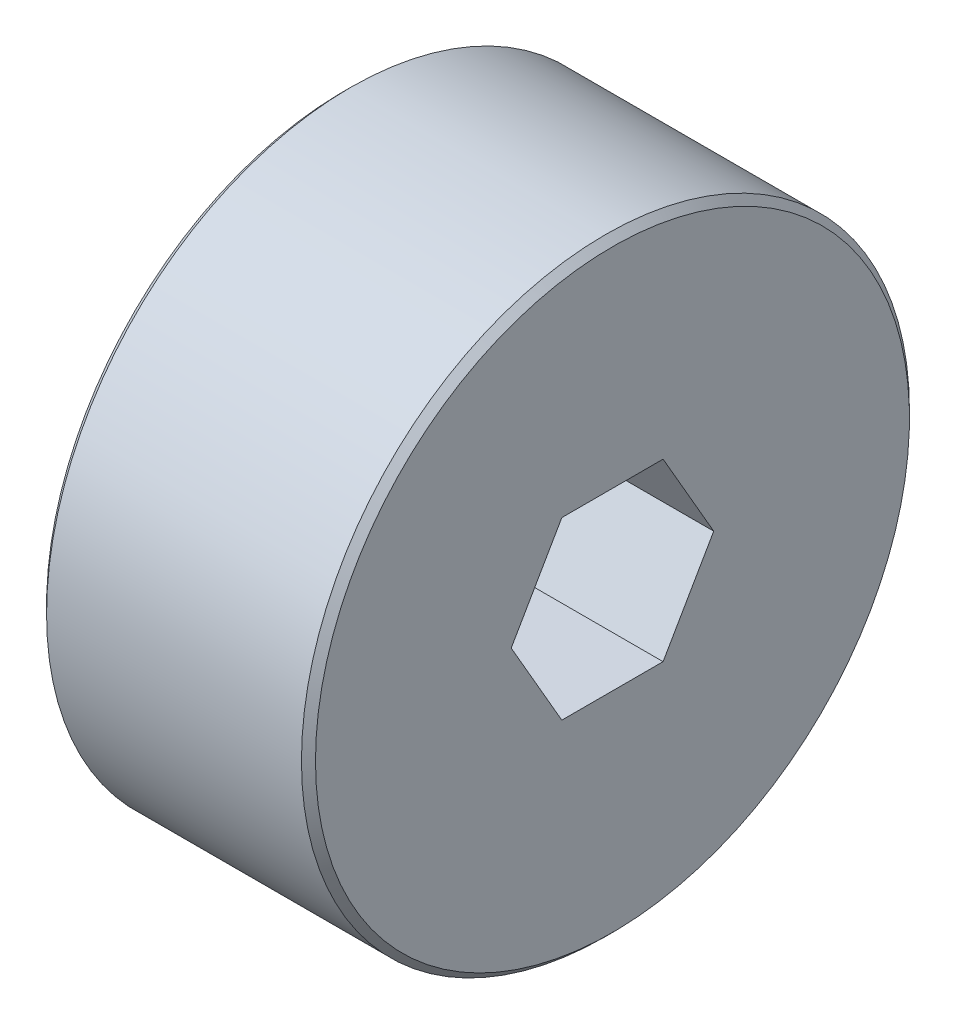
ISO-10303-21;
HEADER;
FILE_DESCRIPTION(('STEP AP214'),'2;1');
FILE_NAME('part.step','',(''),(''),'','','');
FILE_SCHEMA(('AUTOMOTIVE_DESIGN { 1 0 10303 214 1 1 1 1 }'));
ENDSEC;
DATA;
#1=APPLICATION_CONTEXT('core data for automotive mechanical design processes');
#2=APPLICATION_PROTOCOL_DEFINITION('international standard','automotive_design',2000,#1);
#3=PRODUCT_CONTEXT('',#1,'mechanical');
#4=PRODUCT('Part','Part','',(#3));
#5=PRODUCT_RELATED_PRODUCT_CATEGORY('part','',(#4));
#6=PRODUCT_DEFINITION_FORMATION('','',#4);
#7=PRODUCT_DEFINITION_CONTEXT('part definition',#1,'design');
#8=PRODUCT_DEFINITION('design','',#6,#7);
#9=PRODUCT_DEFINITION_SHAPE('','',#8);
#10=(LENGTH_UNIT() NAMED_UNIT(*) SI_UNIT(.MILLI.,.METRE.));
#11=(NAMED_UNIT(*) PLANE_ANGLE_UNIT() SI_UNIT($,.RADIAN.));
#12=(NAMED_UNIT(*) SI_UNIT($,.STERADIAN.) SOLID_ANGLE_UNIT());
#13=UNCERTAINTY_MEASURE_WITH_UNIT(LENGTH_MEASURE(1.E-05),#10,'distance_accuracy_value','');
#14=(GEOMETRIC_REPRESENTATION_CONTEXT(3) GLOBAL_UNCERTAINTY_ASSIGNED_CONTEXT((#13)) GLOBAL_UNIT_ASSIGNED_CONTEXT((#10,
#11,#12)) REPRESENTATION_CONTEXT('',''));
#15=CARTESIAN_POINT('',(0.,0.,0.));
#16=DIRECTION('',(0.,0.,1.));
#17=DIRECTION('',(1.,0.,0.));
#18=AXIS2_PLACEMENT_3D('',#15,#16,#17);
#19=CARTESIAN_POINT('',(814.277078421179,288.105971524835,0.));
#20=DIRECTION('',(1.,0.,0.));
#21=DIRECTION('',(0.,0.,-1.));
#22=AXIS2_PLACEMENT_3D('',#19,#20,#21);
#23=CONICAL_SURFACE('',#22,7.93749999988602,0.785398162499982);
#24=CARTESIAN_POINT('',(814.277078421065,288.105971524835,0.));
#25=DIRECTION('',(1.,0.,0.));
#26=DIRECTION('',(0.,0.,-1.));
#27=AXIS2_PLACEMENT_3D('',#24,#25,#26);
#28=CIRCLE('',#27,7.9375);
#29=CARTESIAN_POINT('',(814.277078421065,288.105971524835,-7.9375));
#30=VERTEX_POINT('',#29);
#31=EDGE_CURVE('E150',#30,#30,#28,.T.);
#32=ORIENTED_EDGE('',*,*,#31,.F.);
#33=EDGE_LOOP('',(#32));
#34=FACE_BOUND('',#33,.T.);
#35=CARTESIAN_POINT('',(814.023078420951,288.105971524835,0.));
#36=DIRECTION('',(1.,0.,0.));
#37=DIRECTION('',(0.,0.,-1.));
#38=AXIS2_PLACEMENT_3D('',#35,#36,#37);
#39=CIRCLE('',#38,7.68350000011392);
#40=CARTESIAN_POINT('',(814.023078420951,288.105971524835,-7.68350000011392));
#41=VERTEX_POINT('',#40);
#42=EDGE_CURVE('E21',#41,#41,#39,.F.);
#43=ORIENTED_EDGE('',*,*,#42,.F.);
#44=EDGE_LOOP('',(#43));
#45=FACE_BOUND('',#44,.T.);
#46=ADVANCED_FACE('F17',(#34,#45),#23,.T.);
#47=CARTESIAN_POINT('',(814.023078421065,292.074721524835,0.));
#48=DIRECTION('',(-1.,0.,0.));
#49=DIRECTION('',(0.,0.,1.));
#50=AXIS2_PLACEMENT_3D('',#47,#48,#49);
#51=PLANE('',#50);
#52=CARTESIAN_POINT('',(814.023078420746,288.105971524835,0.));
#53=DIRECTION('',(-1.,0.,0.));
#54=DIRECTION('',(0.,0.,1.));
#55=AXIS2_PLACEMENT_3D('',#52,#53,#54);
#56=CIRCLE('',#55,5.52449999974425);
#57=CARTESIAN_POINT('',(814.023078420746,288.105971524835,5.52449999974425));
#58=VERTEX_POINT('',#57);
#59=EDGE_CURVE('E118',#58,#58,#56,.F.);
#60=ORIENTED_EDGE('',*,*,#59,.T.);
#61=EDGE_LOOP('',(#60));
#62=FACE_BOUND('',#61,.T.);
#63=ORIENTED_EDGE('',*,*,#42,.T.);
#64=EDGE_LOOP('',(#63));
#65=FACE_BOUND('',#64,.T.);
#66=ADVANCED_FACE('F338',(#62,#65),#51,.T.);
#67=CARTESIAN_POINT('',(814.340578421065,288.105971524835,0.));
#68=DIRECTION('',(1.,0.,0.));
#69=DIRECTION('',(0.,0.,-1.));
#70=AXIS2_PLACEMENT_3D('',#67,#68,#69);
#71=CYLINDRICAL_SURFACE('',#70,7.9375);
#72=CARTESIAN_POINT('',(814.404078421065,288.105971524835,0.));
#73=DIRECTION('',(1.,0.,0.));
#74=DIRECTION('',(0.,0.,-1.));
#75=AXIS2_PLACEMENT_3D('',#72,#73,#74);
#76=CIRCLE('',#75,7.93749999999999);
#77=CARTESIAN_POINT('',(814.404078421065,288.105971524835,-7.93749999999999));
#78=VERTEX_POINT('',#77);
#79=EDGE_CURVE('E85',#78,#78,#76,.T.);
#80=ORIENTED_EDGE('',*,*,#79,.F.);
#81=EDGE_LOOP('',(#80));
#82=FACE_BOUND('',#81,.T.);
#83=ORIENTED_EDGE('',*,*,#31,.T.);
#84=EDGE_LOOP('',(#83));
#85=FACE_BOUND('',#84,.T.);
#86=ADVANCED_FACE('F330',(#82,#85),#71,.T.);
#87=CARTESIAN_POINT('',(814.023078420803,288.105971524835,0.));
#88=DIRECTION('',(-1.,0.,0.));
#89=DIRECTION('',(0.,0.,1.));
#90=AXIS2_PLACEMENT_3D('',#87,#88,#89);
#91=CONICAL_SURFACE('',#90,5.5244999996874,0.785398162507615);
#92=ORIENTED_EDGE('',*,*,#59,.F.);
#93=EDGE_LOOP('',(#92));
#94=FACE_BOUND('',#93,.T.);
#95=CARTESIAN_POINT('',(814.048317106639,288.105971524631,5.49926131399009));
#96=CARTESIAN_POINT('',(814.095276713428,288.024623411087,5.45229495868878));
#97=CARTESIAN_POINT('',(814.14080432843,287.942653725722,5.40496973875758));
#98=CARTESIAN_POINT('',(814.228563619718,287.777350388181,5.30953181231453));
#99=CARTESIAN_POINT('',(814.270793501319,287.694016022754,5.26141869400755));
#100=CARTESIAN_POINT('',(814.392296850374,287.440910903982,5.11528838555948));
#101=CARTESIAN_POINT('',(814.465810044093,287.269011053323,5.01604196050402));
#102=CARTESIAN_POINT('',(814.592709375881,286.920203964327,4.81465809377386));
#103=CARTESIAN_POINT('',(814.646163632112,286.743315907082,4.71253172630691));
#104=CARTESIAN_POINT('',(814.707958642217,286.475098749803,4.5576764783527));
#105=CARTESIAN_POINT('',(814.725482238726,286.385324836492,4.50584548533751));
#106=CARTESIAN_POINT('',(814.75400261081,286.205013555752,4.40174271886136));
#107=CARTESIAN_POINT('',(814.765001556536,286.11447645234,4.34947109783016));
#108=CARTESIAN_POINT('',(814.7767347939,285.973970743115,4.2683500887954));
#109=CARTESIAN_POINT('',(814.779861438079,285.924144265866,4.23958275874976));
#110=CARTESIAN_POINT('',(814.784033652413,285.82445460277,4.1820269049065));
#111=CARTESIAN_POINT('',(814.78508035307,285.774591451607,4.15323840113445));
#112=CARTESIAN_POINT('',(814.785073574796,285.599557812022,4.05218268216171));
#113=CARTESIAN_POINT('',(814.778463276719,285.474351418993,3.97989473749762));
#114=CARTESIAN_POINT('',(814.752384357275,285.224898800092,3.83587320086616));
#115=CARTESIAN_POINT('',(814.732906767529,285.100653305109,3.764140030877));
#116=CARTESIAN_POINT('',(814.682008968795,284.853436092213,3.62140910645207));
#117=CARTESIAN_POINT('',(814.650533839888,284.730472944217,3.55041629986063));
#118=CARTESIAN_POINT('',(814.577079766671,284.486910875475,3.40979567391092));
#119=CARTESIAN_POINT('',(814.535096769832,284.366312886285,3.34016839238749));
#120=CARTESIAN_POINT('',(814.427994134356,284.091302146559,3.18139086777519));
#121=CARTESIAN_POINT('',(814.359724319717,283.937811006125,3.09277271652804));
#122=CARTESIAN_POINT('',(814.248663318791,283.711659062559,2.96220383103236));
#123=CARTESIAN_POINT('',(814.210393068711,283.637284002713,2.9192633702096));
#124=CARTESIAN_POINT('',(814.131237316078,283.489598498439,2.83399710456165));
#125=CARTESIAN_POINT('',(814.090352248931,283.416287879247,2.79167119883672));
#126=CARTESIAN_POINT('',(814.048317106608,283.343471525015,2.74963065711948));
#127=B_SPLINE_CURVE_WITH_KNOTS('',3,(#95,#96,#97,#98,#99,#100,#101,#102,#103,#104,#105,#106,
#107,#108,#109,#110,#111,#112,#113,#114,#115,#116,#117,#118,#119,#120,#121,#122,#123,#124,#125,
#126),.UNSPECIFIED.,.F.,.F.,(4,2,2,2,2,2,2,2,2,2,2,2,2,2,2,4),(0.,0.315033356545603,
0.630236981876394,1.26441953450874,1.89642854621824,2.21165534619422,2.52677724038584,
2.69960160988732,2.87233201930486,3.30585139200733,3.73967324283356,4.17550527965052,
4.61150566186299,5.18066674352936,5.46270108821175,5.74468859165306),.UNSPECIFIED.);
#128=CARTESIAN_POINT('',(814.04831710661,288.105971524835,5.49926131392526));
#129=VERTEX_POINT('',#128);
#130=CARTESIAN_POINT('',(814.04831710661,283.343471524927,2.74963065696263));
#131=VERTEX_POINT('',#130);
#132=EDGE_CURVE('E92',#129,#131,#127,.T.);
#133=ORIENTED_EDGE('',*,*,#132,.T.);
#134=CARTESIAN_POINT('',(814.048317106639,283.343471524769,2.74963065681831));
#135=CARTESIAN_POINT('',(814.095276713428,283.343471524811,2.6556979462883));
#136=CARTESIAN_POINT('',(814.14080432843,283.343471524829,2.56104750645672));
#137=CARTESIAN_POINT('',(814.228563619718,283.343471524842,2.37017165359389));
#138=CARTESIAN_POINT('',(814.270793501319,283.343471524838,2.27394541697236));
#139=CARTESIAN_POINT('',(814.392296850374,283.343471524831,1.98168480006385));
#140=CARTESIAN_POINT('',(814.465810044093,283.343471524834,1.78319194995864));
#141=CARTESIAN_POINT('',(814.592709375881,283.343471524837,1.38042421650349));
#142=CARTESIAN_POINT('',(814.646163632112,283.343471524837,1.1761714815691));
#143=CARTESIAN_POINT('',(814.707958642217,283.343471524835,0.866460985657548));
#144=CARTESIAN_POINT('',(814.725482238726,283.343471524834,0.762798999625741));
#145=CARTESIAN_POINT('',(814.75400261081,283.343471524837,0.5545934666784));
#146=CARTESIAN_POINT('',(814.765001556536,283.343471524841,0.45005022462239));
#147=CARTESIAN_POINT('',(814.7767347939,283.343471524833,0.287808206539142));
#148=CARTESIAN_POINT('',(814.779861438079,283.343471524827,0.230273546438418));
#149=CARTESIAN_POINT('',(814.784033652413,283.343471524844,0.115161838780523));
#150=CARTESIAN_POINT('',(814.78508035307,283.343471524866,0.0575848312744657));
#151=CARTESIAN_POINT('',(814.785073574796,283.343471524902,-0.1445266066089));
#152=CARTESIAN_POINT('',(814.778463276719,283.343471524853,-0.289102496020808));
#153=CARTESIAN_POINT('',(814.752384357275,283.343471524818,-0.5771455693451));
#154=CARTESIAN_POINT('',(814.732906767529,283.343471524831,-0.720611909301002));
#155=CARTESIAN_POINT('',(814.682008968795,283.34347152484,-1.00607375813436));
#156=CARTESIAN_POINT('',(814.650533839888,283.343471524837,-1.14805937132329));
#157=CARTESIAN_POINT('',(814.577079766671,283.343471524834,-1.4293006232272));
#158=CARTESIAN_POINT('',(814.535096769832,283.343471524835,-1.56855518627248));
#159=CARTESIAN_POINT('',(814.427994134356,283.343471524836,-1.88611023549555));
#160=CARTESIAN_POINT('',(814.359724319717,283.343471524836,-2.06334653799052));
#161=CARTESIAN_POINT('',(814.248663318791,283.343471524835,-2.32448430898219));
#162=CARTESIAN_POINT('',(814.210393068711,283.343471524835,-2.4103652306277));
#163=CARTESIAN_POINT('',(814.131237316078,283.343471524835,-2.58089776192351));
#164=CARTESIAN_POINT('',(814.090352248931,283.343471524835,-2.6655495733733));
#165=CARTESIAN_POINT('',(814.048317106608,283.343471524835,-2.74963065680782));
#166=B_SPLINE_CURVE_WITH_KNOTS('',3,(#134,#135,#136,#137,#138,#139,#140,#141,#142,#143,#144,
#145,#146,#147,#148,#149,#150,#151,#152,#153,#154,#155,#156,#157,#158,#159,#160,#161,#162,#163,
#164,#165),.UNSPECIFIED.,.F.,.F.,(4,2,2,2,2,2,2,2,2,2,2,2,2,2,2,4),(0.,0.315033356545621,
0.630236981876475,1.26441953450874,1.89642854621826,2.21165534619423,2.52677724038585,
2.69960160988731,2.87233201930483,3.30585139200723,3.73967324283357,4.17550527965054,
4.61150566186297,5.18066674352941,5.46270108821183,5.74468859165302),.UNSPECIFIED.);
#167=CARTESIAN_POINT('',(814.04831710661,283.343471524927,-2.74963065696263));
#168=VERTEX_POINT('',#167);
#169=EDGE_CURVE('E104',#131,#168,#166,.T.);
#170=ORIENTED_EDGE('',*,*,#169,.T.);
#171=CARTESIAN_POINT('',(814.048317106639,283.343471524973,-2.74963065717178));
#172=CARTESIAN_POINT('',(814.095276713428,283.424819638559,-2.79659701240047));
#173=CARTESIAN_POINT('',(814.14080432843,283.506789323942,-2.84392223230084));
#174=CARTESIAN_POINT('',(814.228563619718,283.672092661497,-2.93936015872059));
#175=CARTESIAN_POINT('',(814.270793501319,283.755427026919,-2.98747327703513));
#176=CARTESIAN_POINT('',(814.392296850374,284.008532145684,-3.13360358549558));
#177=CARTESIAN_POINT('',(814.465810044093,284.180431996346,-3.23285001054535));
#178=CARTESIAN_POINT('',(814.592709375881,284.529239085345,-3.43423387727036));
#179=CARTESIAN_POINT('',(814.646163632112,284.70612714259,-3.53636024473781));
#180=CARTESIAN_POINT('',(814.707958642217,284.974344299868,-3.69121549269513));
#181=CARTESIAN_POINT('',(814.725482238726,285.064118213177,-3.74304648571174));
#182=CARTESIAN_POINT('',(814.75400261081,285.24442949392,-3.84714925218294));
#183=CARTESIAN_POINT('',(814.765001556536,285.334966597336,-3.89942087320776));
#184=CARTESIAN_POINT('',(814.7767347939,285.475472306553,-3.98054188225626));
#185=CARTESIAN_POINT('',(814.779861438079,285.525298783796,-4.00930921231136));
#186=CARTESIAN_POINT('',(814.784033652413,285.624988446909,-4.066865066126));
#187=CARTESIAN_POINT('',(814.78508035307,285.674851598094,-4.09565356985999));
#188=CARTESIAN_POINT('',(814.785073574796,285.849885237714,-4.19670928877062));
#189=CARTESIAN_POINT('',(814.778463276719,285.975091630696,-4.26899723351845));
#190=CARTESIAN_POINT('',(814.752384357275,286.224544249561,-4.4130187702113));
#191=CARTESIAN_POINT('',(814.732906767529,286.348789744557,-4.48475194017803));
#192=CARTESIAN_POINT('',(814.682008968795,286.596006957463,-4.62748286458644));
#193=CARTESIAN_POINT('',(814.650533839888,286.718970105455,-4.69847567118392));
#194=CARTESIAN_POINT('',(814.577079766671,286.962532174195,-4.83909629713811));
#195=CARTESIAN_POINT('',(814.535096769832,287.083130163385,-4.90872357865997));
#196=CARTESIAN_POINT('',(814.427994134356,287.358140903113,-5.06750110327075));
#197=CARTESIAN_POINT('',(814.359724319717,287.511632043546,-5.1561192545186));
#198=CARTESIAN_POINT('',(814.248663318791,287.737783987112,-5.28668814001456));
#199=CARTESIAN_POINT('',(814.210393068711,287.812159046958,-5.32962860083729));
#200=CARTESIAN_POINT('',(814.131237316078,287.959844551232,-5.41489486648514));
#201=CARTESIAN_POINT('',(814.090352248931,288.033155170423,-5.45722077221001));
#202=CARTESIAN_POINT('',(814.048317106608,288.105971524656,-5.49926131392731));
#203=B_SPLINE_CURVE_WITH_KNOTS('',3,(#171,#172,#173,#174,#175,#176,#177,#178,#179,#180,#181,
#182,#183,#184,#185,#186,#187,#188,#189,#190,#191,#192,#193,#194,#195,#196,#197,#198,#199,#200,
#201,#202),.UNSPECIFIED.,.F.,.F.,(4,2,2,2,2,2,2,2,2,2,2,2,2,2,2,4),(0.,0.315033356545598,
0.630236981876397,1.26441953450874,1.89642854621825,2.21165534619422,2.52677724038584,
2.69960160988739,2.87233201930483,3.30585139200726,3.73967324283356,4.17550527965057,
4.611505661863,5.18066674352947,5.46270108821186,5.74468859165306),.UNSPECIFIED.);
#204=CARTESIAN_POINT('',(814.04831710661,288.105971524835,-5.49926131392526));
#205=VERTEX_POINT('',#204);
#206=EDGE_CURVE('E109',#168,#205,#203,.T.);
#207=ORIENTED_EDGE('',*,*,#206,.T.);
#208=CARTESIAN_POINT('',(814.048317106639,288.105971525039,-5.49926131399009));
#209=CARTESIAN_POINT('',(814.095276713428,288.187319638584,-5.45229495868879));
#210=CARTESIAN_POINT('',(814.14080432843,288.269289323948,-5.4049697387576));
#211=CARTESIAN_POINT('',(814.228563619718,288.43459266149,-5.30953181231454));
#212=CARTESIAN_POINT('',(814.270793501319,288.517927026917,-5.26141869400754));
#213=CARTESIAN_POINT('',(814.392296850374,288.771032145689,-5.11528838555945));
#214=CARTESIAN_POINT('',(814.465810044093,288.942931996348,-5.01604196050401));
#215=CARTESIAN_POINT('',(814.592709375881,289.291739085343,-4.81465809377385));
#216=CARTESIAN_POINT('',(814.646163632112,289.468627142589,-4.71253172630691));
#217=CARTESIAN_POINT('',(814.707958642217,289.736844299868,-4.55767647835269));
#218=CARTESIAN_POINT('',(814.725482238726,289.826618213179,-4.50584548533751));
#219=CARTESIAN_POINT('',(814.75400261081,290.006929493918,-4.40174271886136));
#220=CARTESIAN_POINT('',(814.765001556536,290.097466597331,-4.34947109783016));
#221=CARTESIAN_POINT('',(814.7767347939,290.237972306556,-4.2683500887954));
#222=CARTESIAN_POINT('',(814.779861438079,290.287798783804,-4.23958275874976));
#223=CARTESIAN_POINT('',(814.784033652413,290.387488446901,-4.1820269049065));
#224=CARTESIAN_POINT('',(814.78508035307,290.437351598064,-4.15323840113445));
#225=CARTESIAN_POINT('',(814.785073574796,290.612385237648,-4.05218268216172));
#226=CARTESIAN_POINT('',(814.778463276719,290.737591630678,-3.97989473749765));
#227=CARTESIAN_POINT('',(814.752384357275,290.987044249579,-3.8358732008662));
#228=CARTESIAN_POINT('',(814.732906767529,291.111289744562,-3.76414003087702));
#229=CARTESIAN_POINT('',(814.682008968795,291.358506957458,-3.62140910645206));
#230=CARTESIAN_POINT('',(814.650533839888,291.481470105454,-3.55041629986061));
#231=CARTESIAN_POINT('',(814.577079766671,291.725032174196,-3.4097956739109));
#232=CARTESIAN_POINT('',(814.535096769832,291.845630163385,-3.34016839238747));
#233=CARTESIAN_POINT('',(814.427994134356,292.120640903112,-3.18139086777517));
#234=CARTESIAN_POINT('',(814.359724319717,292.274132043546,-3.09277271652801));
#235=CARTESIAN_POINT('',(814.248663318791,292.500283987112,-2.96220383103231));
#236=CARTESIAN_POINT('',(814.210393068711,292.574659046958,-2.91926337020954));
#237=CARTESIAN_POINT('',(814.131237316078,292.722344551232,-2.8339971045616));
#238=CARTESIAN_POINT('',(814.090352248931,292.795655170424,-2.79167119883668));
#239=CARTESIAN_POINT('',(814.048317106608,292.868471524655,-2.74963065711946));
#240=B_SPLINE_CURVE_WITH_KNOTS('',3,(#208,#209,#210,#211,#212,#213,#214,#215,#216,#217,#218,
#219,#220,#221,#222,#223,#224,#225,#226,#227,#228,#229,#230,#231,#232,#233,#234,#235,#236,#237,
#238,#239),.UNSPECIFIED.,.F.,.F.,(4,2,2,2,2,2,2,2,2,2,2,2,2,2,2,4),(0.,0.315033356545594,
0.63023698187645,1.26441953450874,1.89642854621824,2.21165534619422,2.52677724038584,
2.69960160988732,2.87233201930486,3.30585139200726,3.73967324283361,4.17550527965063,
4.61150566186299,5.18066674352947,5.46270108821191,5.74468859165312),.UNSPECIFIED.);
#241=CARTESIAN_POINT('',(814.04831710661,292.868471524744,-2.74963065696262));
#242=VERTEX_POINT('',#241);
#243=EDGE_CURVE('E82',#205,#242,#240,.T.);
#244=ORIENTED_EDGE('',*,*,#243,.T.);
#245=CARTESIAN_POINT('',(814.048317106639,292.868471524902,-2.74963065681832));
#246=CARTESIAN_POINT('',(814.095276713428,292.86847152486,-2.65569794628829));
#247=CARTESIAN_POINT('',(814.14080432843,292.868471524842,-2.56104750645671));
#248=CARTESIAN_POINT('',(814.228563619718,292.868471524829,-2.37017165359389));
#249=CARTESIAN_POINT('',(814.270793501319,292.868471524833,-2.27394541697235));
#250=CARTESIAN_POINT('',(814.392296850374,292.86847152484,-1.98168480006386));
#251=CARTESIAN_POINT('',(814.465810044093,292.868471524837,-1.78319194995865));
#252=CARTESIAN_POINT('',(814.592709375881,292.868471524834,-1.38042421650351));
#253=CARTESIAN_POINT('',(814.646163632112,292.868471524834,-1.17617148156913));
#254=CARTESIAN_POINT('',(814.707958642217,292.868471524836,-0.86646098565758));
#255=CARTESIAN_POINT('',(814.725482238726,292.868471524837,-0.762798999625775));
#256=CARTESIAN_POINT('',(814.75400261081,292.868471524834,-0.55459346667844));
#257=CARTESIAN_POINT('',(814.765001556536,292.86847152483,-0.450050224622433));
#258=CARTESIAN_POINT('',(814.7767347939,292.868471524838,-0.28780820653918));
#259=CARTESIAN_POINT('',(814.779861438079,292.868471524844,-0.230273546438448));
#260=CARTESIAN_POINT('',(814.784033652413,292.868471524827,-0.115161838780538));
#261=CARTESIAN_POINT('',(814.78508035307,292.868471524805,-0.057584831274475));
#262=CARTESIAN_POINT('',(814.785073574796,292.868471524769,0.1445266066089));
#263=CARTESIAN_POINT('',(814.778463276719,292.868471524818,0.289102496020811));
#264=CARTESIAN_POINT('',(814.752384357275,292.868471524853,0.577145569345103));
#265=CARTESIAN_POINT('',(814.732906767529,292.86847152484,0.720611909301002));
#266=CARTESIAN_POINT('',(814.682008968795,292.868471524831,1.00607375813436));
#267=CARTESIAN_POINT('',(814.650533839888,292.868471524834,1.14805937132329));
#268=CARTESIAN_POINT('',(814.577079766671,292.868471524837,1.42930062322719));
#269=CARTESIAN_POINT('',(814.535096769832,292.868471524836,1.56855518627248));
#270=CARTESIAN_POINT('',(814.427994134356,292.868471524835,1.88611023549554));
#271=CARTESIAN_POINT('',(814.359724319717,292.868471524835,2.06334653799052));
#272=CARTESIAN_POINT('',(814.248663318791,292.868471524835,2.32448430898218));
#273=CARTESIAN_POINT('',(814.210393068711,292.868471524835,2.41036523062769));
#274=CARTESIAN_POINT('',(814.131237316078,292.868471524835,2.5808977619235));
#275=CARTESIAN_POINT('',(814.090352248931,292.868471524835,2.66554957337328));
#276=CARTESIAN_POINT('',(814.048317106608,292.868471524835,2.74963065680781));
#277=B_SPLINE_CURVE_WITH_KNOTS('',3,(#245,#246,#247,#248,#249,#250,#251,#252,#253,#254,#255,
#256,#257,#258,#259,#260,#261,#262,#263,#264,#265,#266,#267,#268,#269,#270,#271,#272,#273,#274,
#275,#276),.UNSPECIFIED.,.F.,.F.,(4,2,2,2,2,2,2,2,2,2,2,2,2,2,2,4),(0.,0.315033356545585,
0.630236981876435,1.26441953450868,1.89642854621819,2.21165534619416,2.52677724038576,
2.69960160988726,2.87233201930479,3.3058513920072,3.73967324283353,4.1755052796505,
4.61150566186293,5.18066674352937,5.46270108821178,5.74468859165297),.UNSPECIFIED.);
#278=CARTESIAN_POINT('',(814.048317106557,292.868471524835,2.74963065690967));
#279=VERTEX_POINT('',#278);
#280=EDGE_CURVE('E79',#242,#279,#277,.T.);
#281=ORIENTED_EDGE('',*,*,#280,.T.);
#282=CARTESIAN_POINT('',(814.048317106639,292.868471524698,2.74963065717179));
#283=CARTESIAN_POINT('',(814.095276713428,292.787123411112,2.79659701240048));
#284=CARTESIAN_POINT('',(814.14080432843,292.705153725729,2.84392223230085));
#285=CARTESIAN_POINT('',(814.228563619718,292.539850388174,2.93936015872062));
#286=CARTESIAN_POINT('',(814.270793501319,292.456516022752,2.98747327703516));
#287=CARTESIAN_POINT('',(814.392296850374,292.203410903987,3.13360358549559));
#288=CARTESIAN_POINT('',(814.465810044093,292.031511053324,3.23285001054535));
#289=CARTESIAN_POINT('',(814.592709375881,291.682703964326,3.43423387727033));
#290=CARTESIAN_POINT('',(814.646163632112,291.505815907081,3.53636024473777));
#291=CARTESIAN_POINT('',(814.707958642217,291.237598749803,3.69121549269509));
#292=CARTESIAN_POINT('',(814.725482238726,291.147824836493,3.74304648571171));
#293=CARTESIAN_POINT('',(814.75400261081,290.967513555751,3.84714925218291));
#294=CARTESIAN_POINT('',(814.765001556536,290.876976452335,3.89942087320774));
#295=CARTESIAN_POINT('',(814.7767347939,290.736470743117,3.98054188225621));
#296=CARTESIAN_POINT('',(814.779861438079,290.686644265875,4.00930921231128));
#297=CARTESIAN_POINT('',(814.784033652413,290.586954602762,4.06686506612593));
#298=CARTESIAN_POINT('',(814.78508035307,290.537091451577,4.09565356985996));
#299=CARTESIAN_POINT('',(814.785073574796,290.362057811956,4.19670928877063));
#300=CARTESIAN_POINT('',(814.778463276719,290.236851418975,4.26899723351846));
#301=CARTESIAN_POINT('',(814.752384357275,289.98739880011,4.4130187702113));
#302=CARTESIAN_POINT('',(814.732906767529,289.863153305114,4.48475194017803));
#303=CARTESIAN_POINT('',(814.682008968795,289.615936092208,4.62748286458644));
#304=CARTESIAN_POINT('',(814.650533839888,289.492972944216,4.69847567118392));
#305=CARTESIAN_POINT('',(814.577079766671,289.249410875476,4.83909629713811));
#306=CARTESIAN_POINT('',(814.535096769832,289.128812886286,4.90872357865997));
#307=CARTESIAN_POINT('',(814.427994134356,288.853802146558,5.06750110327073));
#308=CARTESIAN_POINT('',(814.359724319717,288.700311006125,5.15611925451855));
#309=CARTESIAN_POINT('',(814.248663318791,288.474159062559,5.28668814001449));
#310=CARTESIAN_POINT('',(814.210393068711,288.399784002713,5.32962860083722));
#311=CARTESIAN_POINT('',(814.131237316078,288.252098498439,5.41489486648509));
#312=CARTESIAN_POINT('',(814.090352248931,288.178787879247,5.45722077220998));
#313=CARTESIAN_POINT('',(814.048317106608,288.105971525015,5.49926131392731));
#314=B_SPLINE_CURVE_WITH_KNOTS('',3,(#282,#283,#284,#285,#286,#287,#288,#289,#290,#291,#292,
#293,#294,#295,#296,#297,#298,#299,#300,#301,#302,#303,#304,#305,#306,#307,#308,#309,#310,#311,
#312,#313),.UNSPECIFIED.,.F.,.F.,(4,2,2,2,2,2,2,2,2,2,2,2,2,2,2,4),(0.,0.315033356545693,
0.630236981876492,1.26441953450872,1.89642854621819,2.21165534619419,2.52677724038581,
2.69960160988722,2.87233201930487,3.3058513920073,3.7396732428336,4.1755052796506,
4.61150566186303,5.18066674352934,5.46270108821178,5.74468859165309),.UNSPECIFIED.);
#315=EDGE_CURVE('E68',#279,#129,#314,.T.);
#316=ORIENTED_EDGE('',*,*,#315,.T.);
#317=EDGE_LOOP('',(#133,#170,#207,#244,#281,#316));
#318=FACE_BOUND('',#317,.T.);
#319=ADVANCED_FACE('F80',(#94,#318),#91,.F.);
#320=CARTESIAN_POINT('',(814.404078421065,288.105971524835,0.));
#321=DIRECTION('',(1.,0.,0.));
#322=DIRECTION('',(0.,0.,-1.));
#323=AXIS2_PLACEMENT_3D('',#320,#321,#322);
#324=TOROIDAL_SURFACE('',#323,8.19150000000011,0.253999999999905);
#325=CARTESIAN_POINT('',(814.658078421065,288.105971524835,0.));
#326=DIRECTION('',(1.,0.,0.));
#327=DIRECTION('',(0.,0.,-1.));
#328=AXIS2_PLACEMENT_3D('',#325,#326,#327);
#329=CIRCLE('',#328,8.19150000000002);
#330=CARTESIAN_POINT('',(814.658078421065,288.105971524835,-8.19150000000002));
#331=VERTEX_POINT('',#330);
#332=EDGE_CURVE('E134',#331,#331,#329,.T.);
#333=ORIENTED_EDGE('',*,*,#332,.F.);
#334=EDGE_LOOP('',(#333));
#335=FACE_BOUND('',#334,.T.);
#336=ORIENTED_EDGE('',*,*,#79,.T.);
#337=EDGE_LOOP('',(#336));
#338=FACE_BOUND('',#337,.T.);
#339=ADVANCED_FACE('F19',(#335,#338),#324,.F.);
#340=CARTESIAN_POINT('',(814.023078421065,292.868471524835,2.7496306570156));
#341=DIRECTION('',(0.,1.,0.));
#342=DIRECTION('',(0.,0.,1.));
#343=AXIS2_PLACEMENT_3D('',#340,#341,#342);
#344=PLANE('',#343);
#345=DIRECTION('',(1.,0.,0.));
#346=VECTOR('',#345,1.);
#347=CARTESIAN_POINT('',(814.023078421065,292.868471524835,2.7496306570156));
#348=LINE('',#347,#346);
#349=CARTESIAN_POINT('',(829.263078421065,292.868471524835,2.7496306570156));
#350=VERTEX_POINT('',#349);
#351=EDGE_CURVE('E72',#350,#279,#348,.F.);
#352=ORIENTED_EDGE('',*,*,#351,.T.);
#353=ORIENTED_EDGE('',*,*,#280,.F.);
#354=DIRECTION('',(1.,0.,0.));
#355=VECTOR('',#354,1.);
#356=CARTESIAN_POINT('',(814.023078421065,292.868471524835,-2.7496306570156));
#357=LINE('',#356,#355);
#358=CARTESIAN_POINT('',(829.263078421065,292.868471524835,-2.7496306570156));
#359=VERTEX_POINT('',#358);
#360=EDGE_CURVE('E112',#242,#359,#357,.T.);
#361=ORIENTED_EDGE('',*,*,#360,.T.);
#362=DIRECTION('',(0.,0.,-1.));
#363=VECTOR('',#362,1.);
#364=CARTESIAN_POINT('',(829.263078421065,292.868471524835,0.));
#365=LINE('',#364,#363);
#366=EDGE_CURVE('E89',#350,#359,#365,.T.);
#367=ORIENTED_EDGE('',*,*,#366,.F.);
#368=EDGE_LOOP('',(#352,#353,#361,#367));
#369=FACE_BOUND('',#368,.T.);
#370=ADVANCED_FACE('F87',(#369),#344,.F.);
#371=CARTESIAN_POINT('',(814.023078421065,292.868471524835,-2.7496306570156));
#372=DIRECTION('',(0.,0.5,-0.866025403784439));
#373=DIRECTION('',(0.,0.866025403784439,0.5));
#374=AXIS2_PLACEMENT_3D('',#371,#372,#373);
#375=PLANE('',#374);
#376=ORIENTED_EDGE('',*,*,#360,.F.);
#377=ORIENTED_EDGE('',*,*,#243,.F.);
#378=DIRECTION('',(1.,0.,0.));
#379=VECTOR('',#378,1.);
#380=CARTESIAN_POINT('',(814.023078421065,288.105971524835,-5.49926131403119));
#381=LINE('',#380,#379);
#382=CARTESIAN_POINT('',(829.263078421065,288.105971524835,-5.49926131403119));
#383=VERTEX_POINT('',#382);
#384=EDGE_CURVE('E107',#205,#383,#381,.T.);
#385=ORIENTED_EDGE('',*,*,#384,.T.);
#386=DIRECTION('',(0.,-0.866025403784438,-0.5));
#387=VECTOR('',#386,1.);
#388=CARTESIAN_POINT('',(829.263078421065,292.868471524835,-2.7496306570156));
#389=LINE('',#388,#387);
#390=EDGE_CURVE('E133',#359,#383,#389,.T.);
#391=ORIENTED_EDGE('',*,*,#390,.F.);
#392=EDGE_LOOP('',(#376,#377,#385,#391));
#393=FACE_BOUND('',#392,.T.);
#394=ADVANCED_FACE('F207',(#393),#375,.F.);
#395=CARTESIAN_POINT('',(814.023078421065,288.105971524835,-5.49926131403119));
#396=DIRECTION('',(0.,-0.5,-0.866025403784438));
#397=DIRECTION('',(0.,0.866025403784438,-0.5));
#398=AXIS2_PLACEMENT_3D('',#395,#396,#397);
#399=PLANE('',#398);
#400=ORIENTED_EDGE('',*,*,#384,.F.);
#401=ORIENTED_EDGE('',*,*,#206,.F.);
#402=DIRECTION('',(1.,0.,0.));
#403=VECTOR('',#402,1.);
#404=CARTESIAN_POINT('',(814.023078421065,283.343471524835,-2.7496306570156));
#405=LINE('',#404,#403);
#406=CARTESIAN_POINT('',(829.263078421065,283.343471524835,-2.7496306570156));
#407=VERTEX_POINT('',#406);
#408=EDGE_CURVE('E102',#168,#407,#405,.T.);
#409=ORIENTED_EDGE('',*,*,#408,.T.);
#410=DIRECTION('',(0.,-0.866025403784438,0.5));
#411=VECTOR('',#410,1.);
#412=CARTESIAN_POINT('',(829.263078421065,288.105971524835,-5.49926131403119));
#413=LINE('',#412,#411);
#414=EDGE_CURVE('E139',#383,#407,#413,.T.);
#415=ORIENTED_EDGE('',*,*,#414,.F.);
#416=EDGE_LOOP('',(#400,#401,#409,#415));
#417=FACE_BOUND('',#416,.T.);
#418=ADVANCED_FACE('F188',(#417),#399,.F.);
#419=CARTESIAN_POINT('',(814.023078421065,283.343471524835,-2.7496306570156));
#420=DIRECTION('',(0.,-1.,0.));
#421=DIRECTION('',(0.,0.,-1.));
#422=AXIS2_PLACEMENT_3D('',#419,#420,#421);
#423=PLANE('',#422);
#424=ORIENTED_EDGE('',*,*,#408,.F.);
#425=ORIENTED_EDGE('',*,*,#169,.F.);
#426=DIRECTION('',(1.,0.,0.));
#427=VECTOR('',#426,1.);
#428=CARTESIAN_POINT('',(814.023078421065,283.343471524835,2.7496306570156));
#429=LINE('',#428,#427);
#430=CARTESIAN_POINT('',(829.263078421065,283.343471524835,2.7496306570156));
#431=VERTEX_POINT('',#430);
#432=EDGE_CURVE('E90',#131,#431,#429,.T.);
#433=ORIENTED_EDGE('',*,*,#432,.T.);
#434=DIRECTION('',(0.,0.,-1.));
#435=VECTOR('',#434,1.);
#436=CARTESIAN_POINT('',(829.263078421065,283.343471524835,0.));
#437=LINE('',#436,#435);
#438=EDGE_CURVE('E129',#407,#431,#437,.F.);
#439=ORIENTED_EDGE('',*,*,#438,.F.);
#440=EDGE_LOOP('',(#424,#425,#433,#439));
#441=FACE_BOUND('',#440,.T.);
#442=ADVANCED_FACE('F184',(#441),#423,.F.);
#443=CARTESIAN_POINT('',(814.023078421065,283.343471524835,2.7496306570156));
#444=DIRECTION('',(0.,-0.5,0.866025403784439));
#445=DIRECTION('',(0.,-0.866025403784439,-0.5));
#446=AXIS2_PLACEMENT_3D('',#443,#444,#445);
#447=PLANE('',#446);
#448=ORIENTED_EDGE('',*,*,#432,.F.);
#449=ORIENTED_EDGE('',*,*,#132,.F.);
#450=DIRECTION('',(1.,0.,0.));
#451=VECTOR('',#450,1.);
#452=CARTESIAN_POINT('',(814.023078421065,288.105971524835,5.49926131403119));
#453=LINE('',#452,#451);
#454=CARTESIAN_POINT('',(829.263078421065,288.105971524835,5.49926131403119));
#455=VERTEX_POINT('',#454);
#456=EDGE_CURVE('E36',#129,#455,#453,.T.);
#457=ORIENTED_EDGE('',*,*,#456,.T.);
#458=DIRECTION('',(0.,0.866025403784438,0.5));
#459=VECTOR('',#458,1.);
#460=CARTESIAN_POINT('',(829.263078421065,283.343471524835,2.7496306570156));
#461=LINE('',#460,#459);
#462=EDGE_CURVE('E124',#431,#455,#461,.T.);
#463=ORIENTED_EDGE('',*,*,#462,.F.);
#464=EDGE_LOOP('',(#448,#449,#457,#463));
#465=FACE_BOUND('',#464,.T.);
#466=ADVANCED_FACE('F179',(#465),#447,.F.);
#467=CARTESIAN_POINT('',(814.023078421065,288.105971524835,5.49926131403119));
#468=DIRECTION('',(0.,0.5,0.866025403784439));
#469=DIRECTION('',(0.,-0.866025403784439,0.5));
#470=AXIS2_PLACEMENT_3D('',#467,#468,#469);
#471=PLANE('',#470);
#472=ORIENTED_EDGE('',*,*,#456,.F.);
#473=ORIENTED_EDGE('',*,*,#315,.F.);
#474=ORIENTED_EDGE('',*,*,#351,.F.);
#475=DIRECTION('',(0.,0.866025403784438,-0.5));
#476=VECTOR('',#475,1.);
#477=CARTESIAN_POINT('',(829.263078421065,288.105971524835,5.49926131403119));
#478=LINE('',#477,#476);
#479=EDGE_CURVE('E121',#455,#350,#478,.T.);
#480=ORIENTED_EDGE('',*,*,#479,.F.);
#481=EDGE_LOOP('',(#472,#473,#474,#480));
#482=FACE_BOUND('',#481,.T.);
#483=ADVANCED_FACE('F70',(#482),#471,.F.);
#484=CARTESIAN_POINT('',(814.658078421065,300.329721524835,0.));
#485=DIRECTION('',(-1.,0.,0.));
#486=DIRECTION('',(0.,0.,1.));
#487=AXIS2_PLACEMENT_3D('',#484,#485,#486);
#488=PLANE('',#487);
#489=ORIENTED_EDGE('',*,*,#332,.T.);
#490=EDGE_LOOP('',(#489));
#491=FACE_BOUND('',#490,.T.);
#492=CARTESIAN_POINT('',(814.658078420894,288.105971524835,0.));
#493=DIRECTION('',(1.,0.,0.));
#494=DIRECTION('',(0.,0.,-1.));
#495=AXIS2_PLACEMENT_3D('',#492,#493,#494);
#496=CIRCLE('',#495,16.129000000171);
#497=CARTESIAN_POINT('',(814.658078420894,288.105971524835,-16.129000000171));
#498=VERTEX_POINT('',#497);
#499=EDGE_CURVE('E123',#498,#498,#496,.T.);
#500=ORIENTED_EDGE('',*,*,#499,.F.);
#501=EDGE_LOOP('',(#500));
#502=FACE_BOUND('',#501,.T.);
#503=ADVANCED_FACE('F178',(#491,#502),#488,.T.);
#504=CARTESIAN_POINT('',(829.263078421065,296.360971524835,0.));
#505=DIRECTION('',(1.,0.,0.));
#506=DIRECTION('',(0.,0.,-1.));
#507=AXIS2_PLACEMENT_3D('',#504,#505,#506);
#508=PLANE('',#507);
#509=ORIENTED_EDGE('',*,*,#462,.T.);
#510=ORIENTED_EDGE('',*,*,#479,.T.);
#511=ORIENTED_EDGE('',*,*,#366,.T.);
#512=ORIENTED_EDGE('',*,*,#390,.T.);
#513=ORIENTED_EDGE('',*,*,#414,.T.);
#514=ORIENTED_EDGE('',*,*,#438,.T.);
#515=EDGE_LOOP('',(#509,#510,#511,#512,#513,#514));
#516=FACE_BOUND('',#515,.T.);
#517=CARTESIAN_POINT('',(829.263078421236,288.105971524835,0.));
#518=DIRECTION('',(-1.,0.,0.));
#519=DIRECTION('',(0.,0.,1.));
#520=AXIS2_PLACEMENT_3D('',#517,#518,#519);
#521=CIRCLE('',#520,16.129000000171);
#522=CARTESIAN_POINT('',(829.263078421236,288.105971524835,16.129000000171));
#523=VERTEX_POINT('',#522);
#524=EDGE_CURVE('E155',#523,#523,#521,.T.);
#525=ORIENTED_EDGE('',*,*,#524,.F.);
#526=EDGE_LOOP('',(#525));
#527=FACE_BOUND('',#526,.T.);
#528=ADVANCED_FACE('F232',(#516,#527),#508,.T.);
#529=CARTESIAN_POINT('',(815.039078421236,288.105971524835,0.));
#530=DIRECTION('',(1.,0.,0.));
#531=DIRECTION('',(0.,0.,-1.));
#532=AXIS2_PLACEMENT_3D('',#529,#530,#531);
#533=CONICAL_SURFACE('',#532,16.509999999829,0.785398162499945);
#534=CARTESIAN_POINT('',(815.039078421065,288.105971524835,0.));
#535=DIRECTION('',(1.,0.,0.));
#536=DIRECTION('',(0.,0.,-1.));
#537=AXIS2_PLACEMENT_3D('',#534,#535,#536);
#538=CIRCLE('',#537,16.51);
#539=CARTESIAN_POINT('',(815.039078421065,288.105971524835,-16.51));
#540=VERTEX_POINT('',#539);
#541=EDGE_CURVE('E27',#540,#540,#538,.T.);
#542=ORIENTED_EDGE('',*,*,#541,.F.);
#543=EDGE_LOOP('',(#542));
#544=FACE_BOUND('',#543,.T.);
#545=ORIENTED_EDGE('',*,*,#499,.T.);
#546=EDGE_LOOP('',(#545));
#547=FACE_BOUND('',#546,.T.);
#548=ADVANCED_FACE('F226',(#544,#547),#533,.T.);
#549=CARTESIAN_POINT('',(828.882078420894,288.105971524835,0.));
#550=DIRECTION('',(-1.,0.,0.));
#551=DIRECTION('',(0.,0.,1.));
#552=AXIS2_PLACEMENT_3D('',#549,#550,#551);
#553=CONICAL_SURFACE('',#552,16.5099999998291,0.785398162500164);
#554=ORIENTED_EDGE('',*,*,#524,.T.);
#555=EDGE_LOOP('',(#554));
#556=FACE_BOUND('',#555,.T.);
#557=CARTESIAN_POINT('',(828.882078421065,288.105971524835,0.));
#558=DIRECTION('',(1.,0.,0.));
#559=DIRECTION('',(0.,0.,-1.));
#560=AXIS2_PLACEMENT_3D('',#557,#558,#559);
#561=CIRCLE('',#560,16.51);
#562=CARTESIAN_POINT('',(828.882078421065,288.105971524835,-16.51));
#563=VERTEX_POINT('',#562);
#564=EDGE_CURVE('E11',#563,#563,#561,.F.);
#565=ORIENTED_EDGE('',*,*,#564,.F.);
#566=EDGE_LOOP('',(#565));
#567=FACE_BOUND('',#566,.T.);
#568=ADVANCED_FACE('F220',(#556,#567),#553,.T.);
#569=CARTESIAN_POINT('',(821.960578421065,288.105971524835,0.));
#570=DIRECTION('',(1.,0.,0.));
#571=DIRECTION('',(0.,0.,-1.));
#572=AXIS2_PLACEMENT_3D('',#569,#570,#571);
#573=CYLINDRICAL_SURFACE('',#572,16.51);
#574=ORIENTED_EDGE('',*,*,#564,.T.);
#575=EDGE_LOOP('',(#574));
#576=FACE_BOUND('',#575,.T.);
#577=ORIENTED_EDGE('',*,*,#541,.T.);
#578=EDGE_LOOP('',(#577));
#579=FACE_BOUND('',#578,.T.);
#580=ADVANCED_FACE('F218',(#576,#579),#573,.T.);
#581=CLOSED_SHELL('',(#46,#66,#86,#319,#339,#370,#394,#418,#442,#466,#483,#503,#528,#548,#568,#580));
#582=MANIFOLD_SOLID_BREP('B1',#581);
#583=ADVANCED_BREP_SHAPE_REPRESENTATION('',(#18,#582),#14);
#584=SHAPE_DEFINITION_REPRESENTATION(#9,#583);
ENDSEC;
END-ISO-10303-21;
